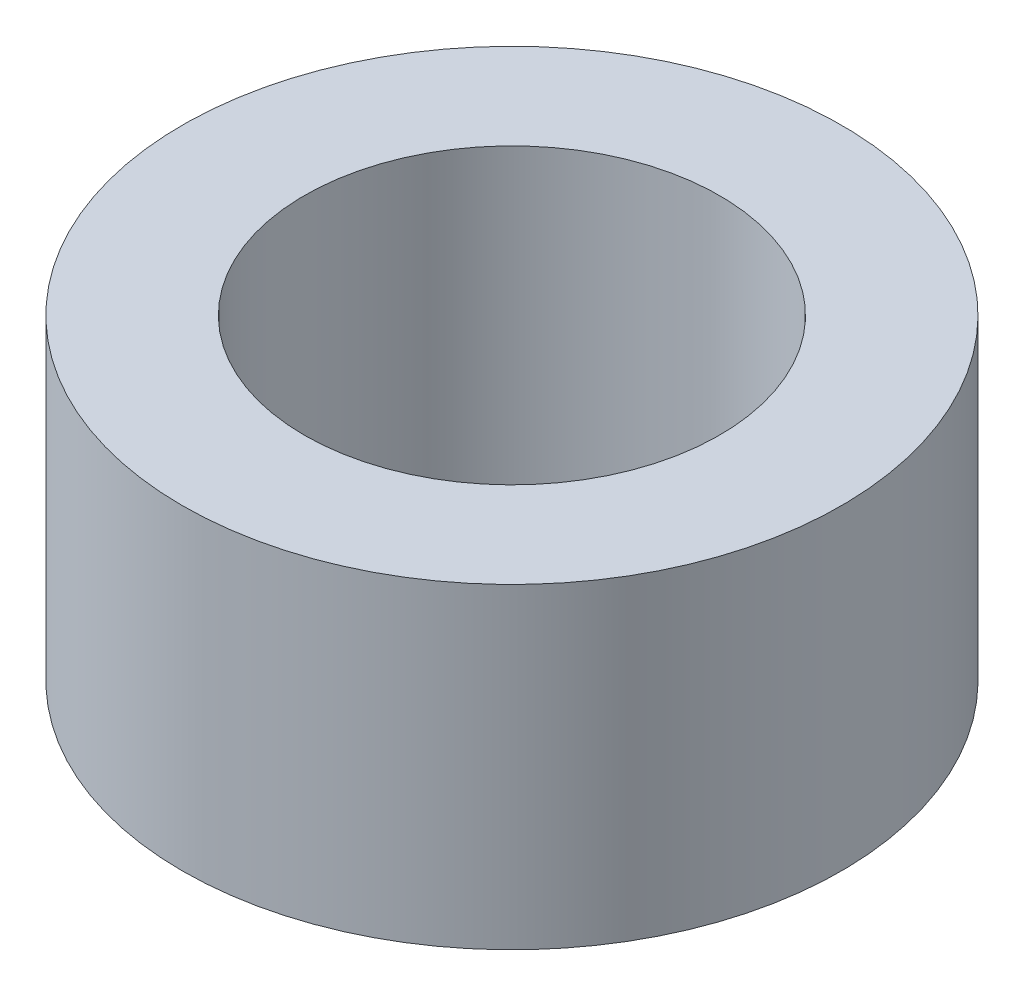
ISO-10303-21;
HEADER;
FILE_DESCRIPTION(('STEP AP214'),'2;1');
FILE_NAME('part.step','',(''),(''),'','','');
FILE_SCHEMA(('AUTOMOTIVE_DESIGN { 1 0 10303 214 1 1 1 1 }'));
ENDSEC;
DATA;
#1=APPLICATION_CONTEXT('core data for automotive mechanical design processes');
#2=APPLICATION_PROTOCOL_DEFINITION('international standard','automotive_design',2000,#1);
#3=PRODUCT_CONTEXT('',#1,'mechanical');
#4=PRODUCT('Part','Part','',(#3));
#5=PRODUCT_RELATED_PRODUCT_CATEGORY('part','',(#4));
#6=PRODUCT_DEFINITION_FORMATION('','',#4);
#7=PRODUCT_DEFINITION_CONTEXT('part definition',#1,'design');
#8=PRODUCT_DEFINITION('design','',#6,#7);
#9=PRODUCT_DEFINITION_SHAPE('','',#8);
#10=(LENGTH_UNIT() NAMED_UNIT(*) SI_UNIT(.MILLI.,.METRE.));
#11=(NAMED_UNIT(*) PLANE_ANGLE_UNIT() SI_UNIT($,.RADIAN.));
#12=(NAMED_UNIT(*) SI_UNIT($,.STERADIAN.) SOLID_ANGLE_UNIT());
#13=UNCERTAINTY_MEASURE_WITH_UNIT(LENGTH_MEASURE(1.E-05),#10,'distance_accuracy_value','');
#14=(GEOMETRIC_REPRESENTATION_CONTEXT(3) GLOBAL_UNCERTAINTY_ASSIGNED_CONTEXT((#13)) GLOBAL_UNIT_ASSIGNED_CONTEXT((#10,
#11,#12)) REPRESENTATION_CONTEXT('',''));
#15=CARTESIAN_POINT('',(0.,0.,0.));
#16=DIRECTION('',(0.,0.,1.));
#17=DIRECTION('',(1.,0.,0.));
#18=AXIS2_PLACEMENT_3D('',#15,#16,#17);
#19=CARTESIAN_POINT('',(0.,-3.048,0.));
#20=DIRECTION('',(0.,1.,0.));
#21=DIRECTION('',(0.,0.,1.));
#22=AXIS2_PLACEMENT_3D('',#19,#20,#21);
#23=CYLINDRICAL_SURFACE('',#22,3.175);
#24=CARTESIAN_POINT('',(0.,-3.048,0.));
#25=DIRECTION('',(0.,1.,0.));
#26=DIRECTION('',(0.,0.,1.));
#27=AXIS2_PLACEMENT_3D('',#24,#25,#26);
#28=CIRCLE('',#27,3.175);
#29=CARTESIAN_POINT('',(0.,-3.048,3.175));
#30=VERTEX_POINT('',#29);
#31=EDGE_CURVE('E10',#30,#30,#28,.T.);
#32=ORIENTED_EDGE('',*,*,#31,.T.);
#33=EDGE_LOOP('',(#32));
#34=FACE_BOUND('',#33,.T.);
#35=CARTESIAN_POINT('',(0.,0.,0.));
#36=DIRECTION('',(0.,1.,0.));
#37=DIRECTION('',(0.,0.,1.));
#38=AXIS2_PLACEMENT_3D('',#35,#36,#37);
#39=CIRCLE('',#38,3.175);
#40=CARTESIAN_POINT('',(0.,0.,3.175));
#41=VERTEX_POINT('',#40);
#42=EDGE_CURVE('E40',#41,#41,#39,.T.);
#43=ORIENTED_EDGE('',*,*,#42,.F.);
#44=EDGE_LOOP('',(#43));
#45=FACE_BOUND('',#44,.T.);
#46=ADVANCED_FACE('F37',(#34,#45),#23,.T.);
#47=CARTESIAN_POINT('',(0.,-3.048,0.));
#48=DIRECTION('',(0.,1.,0.));
#49=DIRECTION('',(0.,0.,1.));
#50=AXIS2_PLACEMENT_3D('',#47,#48,#49);
#51=PLANE('',#50);
#52=CARTESIAN_POINT('',(0.,-3.048,0.));
#53=DIRECTION('',(0.,1.,0.));
#54=DIRECTION('',(0.,0.,1.));
#55=AXIS2_PLACEMENT_3D('',#52,#53,#54);
#56=CIRCLE('',#55,1.999996);
#57=CARTESIAN_POINT('',(0.,-3.048,1.999996));
#58=VERTEX_POINT('',#57);
#59=EDGE_CURVE('E49',#58,#58,#56,.T.);
#60=ORIENTED_EDGE('',*,*,#59,.T.);
#61=EDGE_LOOP('',(#60));
#62=FACE_BOUND('',#61,.T.);
#63=ORIENTED_EDGE('',*,*,#31,.F.);
#64=EDGE_LOOP('',(#63));
#65=FACE_BOUND('',#64,.T.);
#66=ADVANCED_FACE('F59',(#62,#65),#51,.F.);
#67=CARTESIAN_POINT('',(0.,0.,0.));
#68=DIRECTION('',(0.,1.,0.));
#69=DIRECTION('',(0.,0.,1.));
#70=AXIS2_PLACEMENT_3D('',#67,#68,#69);
#71=PLANE('',#70);
#72=CARTESIAN_POINT('',(0.,0.,0.));
#73=DIRECTION('',(0.,1.,0.));
#74=DIRECTION('',(0.,0.,1.));
#75=AXIS2_PLACEMENT_3D('',#72,#73,#74);
#76=CIRCLE('',#75,1.999996);
#77=CARTESIAN_POINT('',(0.,0.,1.999996));
#78=VERTEX_POINT('',#77);
#79=EDGE_CURVE('E51',#78,#78,#76,.T.);
#80=ORIENTED_EDGE('',*,*,#79,.F.);
#81=EDGE_LOOP('',(#80));
#82=FACE_BOUND('',#81,.T.);
#83=ORIENTED_EDGE('',*,*,#42,.T.);
#84=EDGE_LOOP('',(#83));
#85=FACE_BOUND('',#84,.T.);
#86=ADVANCED_FACE('F65',(#82,#85),#71,.T.);
#87=CARTESIAN_POINT('',(0.,-3.048,0.));
#88=DIRECTION('',(0.,1.,0.));
#89=DIRECTION('',(0.,0.,1.));
#90=AXIS2_PLACEMENT_3D('',#87,#88,#89);
#91=CYLINDRICAL_SURFACE('',#90,1.999996);
#92=ORIENTED_EDGE('',*,*,#59,.F.);
#93=EDGE_LOOP('',(#92));
#94=FACE_BOUND('',#93,.T.);
#95=ORIENTED_EDGE('',*,*,#79,.T.);
#96=EDGE_LOOP('',(#95));
#97=FACE_BOUND('',#96,.T.);
#98=ADVANCED_FACE('F62',(#94,#97),#91,.F.);
#99=CLOSED_SHELL('',(#46,#66,#86,#98));
#100=MANIFOLD_SOLID_BREP('B2',#99);
#101=ADVANCED_BREP_SHAPE_REPRESENTATION('',(#18,#100),#14);
#102=SHAPE_DEFINITION_REPRESENTATION(#9,#101);
ENDSEC;
END-ISO-10303-21;
